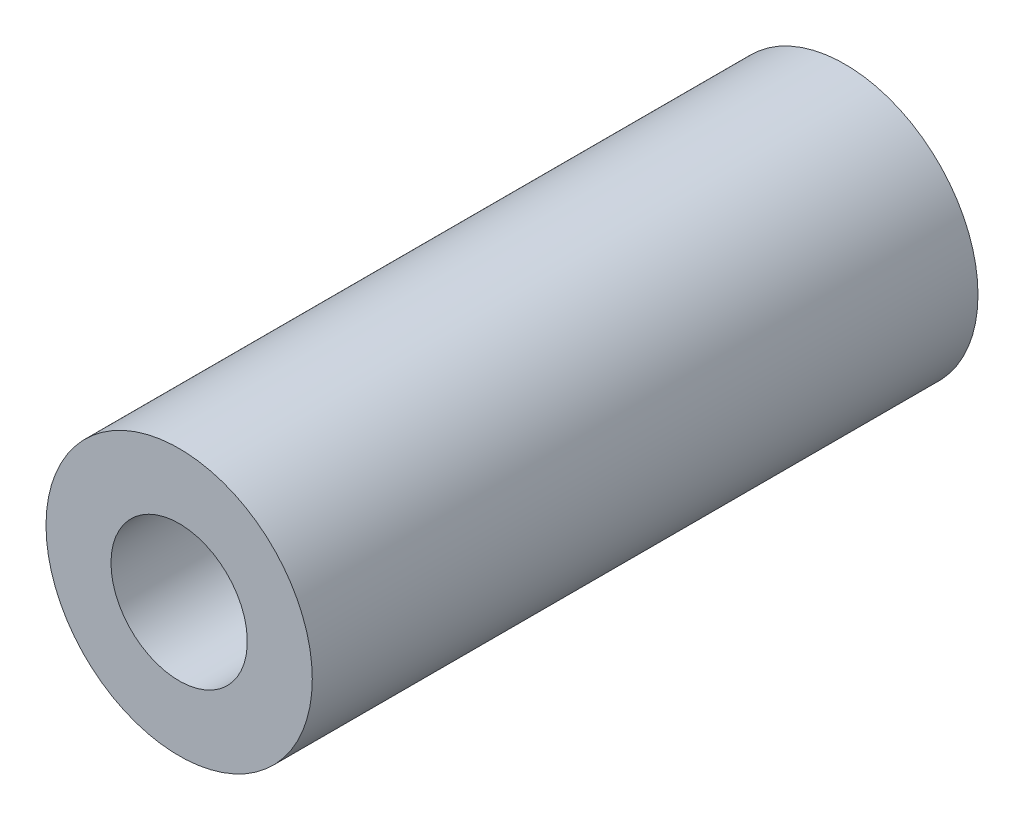
ISO-10303-21;
HEADER;
FILE_DESCRIPTION(('STEP AP214'),'2;1');
FILE_NAME('part.step','',(''),(''),'','','');
FILE_SCHEMA(('AUTOMOTIVE_DESIGN { 1 0 10303 214 1 1 1 1 }'));
ENDSEC;
DATA;
#1=APPLICATION_CONTEXT('core data for automotive mechanical design processes');
#2=APPLICATION_PROTOCOL_DEFINITION('international standard','automotive_design',2000,#1);
#3=PRODUCT_CONTEXT('',#1,'mechanical');
#4=PRODUCT('Part','Part','',(#3));
#5=PRODUCT_RELATED_PRODUCT_CATEGORY('part','',(#4));
#6=PRODUCT_DEFINITION_FORMATION('','',#4);
#7=PRODUCT_DEFINITION_CONTEXT('part definition',#1,'design');
#8=PRODUCT_DEFINITION('design','',#6,#7);
#9=PRODUCT_DEFINITION_SHAPE('','',#8);
#10=(LENGTH_UNIT() NAMED_UNIT(*) SI_UNIT(.MILLI.,.METRE.));
#11=(NAMED_UNIT(*) PLANE_ANGLE_UNIT() SI_UNIT($,.RADIAN.));
#12=(NAMED_UNIT(*) SI_UNIT($,.STERADIAN.) SOLID_ANGLE_UNIT());
#13=UNCERTAINTY_MEASURE_WITH_UNIT(LENGTH_MEASURE(1.E-05),#10,'distance_accuracy_value','');
#14=(GEOMETRIC_REPRESENTATION_CONTEXT(3) GLOBAL_UNCERTAINTY_ASSIGNED_CONTEXT((#13)) GLOBAL_UNIT_ASSIGNED_CONTEXT((#10,
#11,#12)) REPRESENTATION_CONTEXT('',''));
#15=CARTESIAN_POINT('',(0.,0.,0.));
#16=DIRECTION('',(0.,0.,1.));
#17=DIRECTION('',(1.,0.,0.));
#18=AXIS2_PLACEMENT_3D('',#15,#16,#17);
#19=CARTESIAN_POINT('',(0.,0.,11.90625));
#20=DIRECTION('',(0.,0.,-1.));
#21=DIRECTION('',(-1.,0.,0.));
#22=AXIS2_PLACEMENT_3D('',#19,#20,#21);
#23=CYLINDRICAL_SURFACE('',#22,2.4384);
#24=CARTESIAN_POINT('',(0.,0.,-11.90625));
#25=DIRECTION('',(0.,0.,-1.));
#26=DIRECTION('',(-1.,0.,0.));
#27=AXIS2_PLACEMENT_3D('',#24,#25,#26);
#28=CIRCLE('',#27,2.4384);
#29=CARTESIAN_POINT('',(-2.4384,0.,-11.90625));
#30=VERTEX_POINT('',#29);
#31=EDGE_CURVE('E27',#30,#30,#28,.T.);
#32=ORIENTED_EDGE('',*,*,#31,.T.);
#33=EDGE_LOOP('',(#32));
#34=FACE_BOUND('',#33,.T.);
#35=CARTESIAN_POINT('',(0.,0.,11.90625));
#36=DIRECTION('',(0.,0.,-1.));
#37=DIRECTION('',(-1.,0.,0.));
#38=AXIS2_PLACEMENT_3D('',#35,#36,#37);
#39=CIRCLE('',#38,2.4384);
#40=CARTESIAN_POINT('',(-2.4384,0.,11.90625));
#41=VERTEX_POINT('',#40);
#42=EDGE_CURVE('E18',#41,#41,#39,.T.);
#43=ORIENTED_EDGE('',*,*,#42,.F.);
#44=EDGE_LOOP('',(#43));
#45=FACE_BOUND('',#44,.T.);
#46=ADVANCED_FACE('F15',(#34,#45),#23,.F.);
#47=CARTESIAN_POINT('',(0.,0.,11.90625));
#48=DIRECTION('',(0.,0.,1.));
#49=DIRECTION('',(1.,0.,0.));
#50=AXIS2_PLACEMENT_3D('',#47,#48,#49);
#51=PLANE('',#50);
#52=ORIENTED_EDGE('',*,*,#42,.T.);
#53=EDGE_LOOP('',(#52));
#54=FACE_BOUND('',#53,.T.);
#55=CARTESIAN_POINT('',(0.,0.,11.90625));
#56=DIRECTION('',(0.,0.,-1.));
#57=DIRECTION('',(-1.,0.,0.));
#58=AXIS2_PLACEMENT_3D('',#55,#56,#57);
#59=CIRCLE('',#58,4.7625);
#60=CARTESIAN_POINT('',(-4.7625,0.,11.90625));
#61=VERTEX_POINT('',#60);
#62=EDGE_CURVE('E22',#61,#61,#59,.T.);
#63=ORIENTED_EDGE('',*,*,#62,.F.);
#64=EDGE_LOOP('',(#63));
#65=FACE_BOUND('',#64,.T.);
#66=ADVANCED_FACE('F35',(#54,#65),#51,.T.);
#67=CARTESIAN_POINT('',(0.,0.,-11.90625));
#68=DIRECTION('',(0.,0.,1.));
#69=DIRECTION('',(1.,0.,0.));
#70=AXIS2_PLACEMENT_3D('',#67,#68,#69);
#71=PLANE('',#70);
#72=ORIENTED_EDGE('',*,*,#31,.F.);
#73=EDGE_LOOP('',(#72));
#74=FACE_BOUND('',#73,.T.);
#75=CARTESIAN_POINT('',(0.,0.,-11.90625));
#76=DIRECTION('',(0.,0.,-1.));
#77=DIRECTION('',(-1.,0.,0.));
#78=AXIS2_PLACEMENT_3D('',#75,#76,#77);
#79=CIRCLE('',#78,4.7625);
#80=CARTESIAN_POINT('',(-4.7625,0.,-11.90625));
#81=VERTEX_POINT('',#80);
#82=EDGE_CURVE('E10',#81,#81,#79,.F.);
#83=ORIENTED_EDGE('',*,*,#82,.F.);
#84=EDGE_LOOP('',(#83));
#85=FACE_BOUND('',#84,.T.);
#86=ADVANCED_FACE('F43',(#74,#85),#71,.F.);
#87=CARTESIAN_POINT('',(0.,0.,11.90625));
#88=DIRECTION('',(0.,0.,-1.));
#89=DIRECTION('',(-1.,0.,0.));
#90=AXIS2_PLACEMENT_3D('',#87,#88,#89);
#91=CYLINDRICAL_SURFACE('',#90,4.7625);
#92=ORIENTED_EDGE('',*,*,#82,.T.);
#93=EDGE_LOOP('',(#92));
#94=FACE_BOUND('',#93,.T.);
#95=ORIENTED_EDGE('',*,*,#62,.T.);
#96=EDGE_LOOP('',(#95));
#97=FACE_BOUND('',#96,.T.);
#98=ADVANCED_FACE('F44',(#94,#97),#91,.T.);
#99=CLOSED_SHELL('',(#46,#66,#86,#98));
#100=MANIFOLD_SOLID_BREP('B1',#99);
#101=ADVANCED_BREP_SHAPE_REPRESENTATION('',(#18,#100),#14);
#102=SHAPE_DEFINITION_REPRESENTATION(#9,#101);
ENDSEC;
END-ISO-10303-21;
